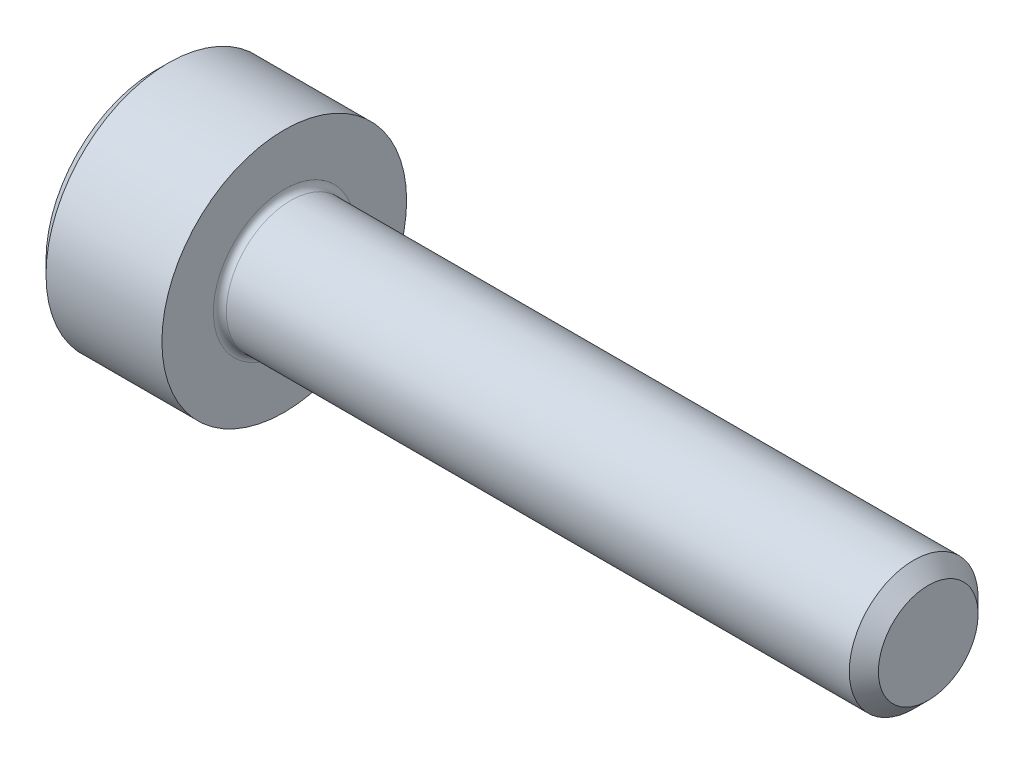
ISO-10303-21;
HEADER;
FILE_DESCRIPTION(('STEP AP214'),'2;1');
FILE_NAME('part.step','',(''),(''),'','','');
FILE_SCHEMA(('AUTOMOTIVE_DESIGN { 1 0 10303 214 1 1 1 1 }'));
ENDSEC;
DATA;
#1=APPLICATION_CONTEXT('core data for automotive mechanical design processes');
#2=APPLICATION_PROTOCOL_DEFINITION('international standard','automotive_design',2000,#1);
#3=PRODUCT_CONTEXT('',#1,'mechanical');
#4=PRODUCT('Part','Part','',(#3));
#5=PRODUCT_RELATED_PRODUCT_CATEGORY('part','',(#4));
#6=PRODUCT_DEFINITION_FORMATION('','',#4);
#7=PRODUCT_DEFINITION_CONTEXT('part definition',#1,'design');
#8=PRODUCT_DEFINITION('design','',#6,#7);
#9=PRODUCT_DEFINITION_SHAPE('','',#8);
#10=(LENGTH_UNIT() NAMED_UNIT(*) SI_UNIT(.MILLI.,.METRE.));
#11=(NAMED_UNIT(*) PLANE_ANGLE_UNIT() SI_UNIT($,.RADIAN.));
#12=(NAMED_UNIT(*) SI_UNIT($,.STERADIAN.) SOLID_ANGLE_UNIT());
#13=UNCERTAINTY_MEASURE_WITH_UNIT(LENGTH_MEASURE(1.E-05),#10,'distance_accuracy_value','');
#14=(GEOMETRIC_REPRESENTATION_CONTEXT(3) GLOBAL_UNCERTAINTY_ASSIGNED_CONTEXT((#13)) GLOBAL_UNIT_ASSIGNED_CONTEXT((#10,
#11,#12)) REPRESENTATION_CONTEXT('',''));
#15=CARTESIAN_POINT('',(0.,0.,0.));
#16=DIRECTION('',(0.,0.,1.));
#17=DIRECTION('',(1.,0.,0.));
#18=AXIS2_PLACEMENT_3D('',#15,#16,#17);
#19=CARTESIAN_POINT('',(0.,0.,0.));
#20=DIRECTION('',(-1.,0.,0.));
#21=DIRECTION('',(0.,0.,1.));
#22=AXIS2_PLACEMENT_3D('',#19,#20,#21);
#23=PLANE('',#22);
#24=DIRECTION('',(0.,-0.499999999999999,0.866025403784439));
#25=VECTOR('',#24,1.);
#26=CARTESIAN_POINT('',(0.,0.892006165897969,0.));
#27=LINE('',#26,#25);
#28=CARTESIAN_POINT('',(0.,0.892006165897969,0.));
#29=VERTEX_POINT('',#28);
#30=CARTESIAN_POINT('',(0.,0.446003082948983,0.772499999999997));
#31=VERTEX_POINT('',#30);
#32=EDGE_CURVE('E391',#29,#31,#27,.T.);
#33=ORIENTED_EDGE('',*,*,#32,.T.);
#34=DIRECTION('',(0.,1.,0.));
#35=VECTOR('',#34,1.);
#36=CARTESIAN_POINT('',(0.,-0.446003082948989,0.772499999999998));
#37=LINE('',#36,#35);
#38=CARTESIAN_POINT('',(0.,-0.446003082948989,0.772499999999998));
#39=VERTEX_POINT('',#38);
#40=EDGE_CURVE('E133',#39,#31,#37,.T.);
#41=ORIENTED_EDGE('',*,*,#40,.F.);
#42=DIRECTION('',(0.,-0.500000000000001,-0.866025403784438));
#43=VECTOR('',#42,1.);
#44=CARTESIAN_POINT('',(0.,-0.446003082948989,0.772499999999998));
#45=LINE('',#44,#43);
#46=CARTESIAN_POINT('',(0.,-0.892006165897975,0.));
#47=VERTEX_POINT('',#46);
#48=EDGE_CURVE('E394',#39,#47,#45,.T.);
#49=ORIENTED_EDGE('',*,*,#48,.T.);
#50=DIRECTION('',(0.,0.499999999999999,-0.866025403784439));
#51=VECTOR('',#50,1.);
#52=CARTESIAN_POINT('',(0.,-0.892006165897975,0.));
#53=LINE('',#52,#51);
#54=CARTESIAN_POINT('',(0.,-0.44600308294899,-0.772500000000001));
#55=VERTEX_POINT('',#54);
#56=EDGE_CURVE('E397',#47,#55,#53,.T.);
#57=ORIENTED_EDGE('',*,*,#56,.T.);
#58=DIRECTION('',(0.,-1.,0.));
#59=VECTOR('',#58,1.);
#60=CARTESIAN_POINT('',(0.,0.446003082948982,-0.772500000000003));
#61=LINE('',#60,#59);
#62=CARTESIAN_POINT('',(0.,0.446003082948982,-0.772500000000003));
#63=VERTEX_POINT('',#62);
#64=EDGE_CURVE('E400',#63,#55,#61,.T.);
#65=ORIENTED_EDGE('',*,*,#64,.F.);
#66=DIRECTION('',(0.,-0.500000000000001,-0.866025403784438));
#67=VECTOR('',#66,1.);
#68=CARTESIAN_POINT('',(0.,0.892006165897969,0.));
#69=LINE('',#68,#67);
#70=EDGE_CURVE('E128',#29,#63,#69,.T.);
#71=ORIENTED_EDGE('',*,*,#70,.F.);
#72=EDGE_LOOP('',(#33,#41,#49,#57,#65,#71));
#73=FACE_BOUND('',#72,.T.);
#74=CARTESIAN_POINT('',(0.,0.,0.));
#75=DIRECTION('',(-1.,0.,0.));
#76=DIRECTION('',(0.,0.,1.));
#77=AXIS2_PLACEMENT_3D('',#74,#75,#76);
#78=CIRCLE('',#77,1.7);
#79=CARTESIAN_POINT('',(0.,0.,1.7));
#80=VERTEX_POINT('',#79);
#81=EDGE_CURVE('E144',#80,#80,#78,.T.);
#82=ORIENTED_EDGE('',*,*,#81,.T.);
#83=EDGE_LOOP('',(#82));
#84=FACE_BOUND('',#83,.T.);
#85=ADVANCED_FACE('F37',(#73,#84),#23,.T.);
#86=CARTESIAN_POINT('',(12.,0.774,0.));
#87=DIRECTION('',(1.,0.,0.));
#88=DIRECTION('',(0.,0.,-1.));
#89=AXIS2_PLACEMENT_3D('',#86,#87,#88);
#90=PLANE('',#89);
#91=CARTESIAN_POINT('',(12.,0.,0.));
#92=DIRECTION('',(-1.,0.,0.));
#93=DIRECTION('',(0.,0.,1.));
#94=AXIS2_PLACEMENT_3D('',#91,#92,#93);
#95=CIRCLE('',#94,0.774);
#96=CARTESIAN_POINT('',(12.,0.,0.774));
#97=VERTEX_POINT('',#96);
#98=EDGE_CURVE('E157',#97,#97,#95,.T.);
#99=ORIENTED_EDGE('',*,*,#98,.F.);
#100=EDGE_LOOP('',(#99));
#101=FACE_BOUND('',#100,.T.);
#102=ADVANCED_FACE('F178',(#101),#90,.T.);
#103=CARTESIAN_POINT('',(12.,0.,0.));
#104=DIRECTION('',(-1.,0.,0.));
#105=DIRECTION('',(0.,0.,1.));
#106=AXIS2_PLACEMENT_3D('',#103,#104,#105);
#107=CONICAL_SURFACE('',#106,0.774,0.785398163397409);
#108=CARTESIAN_POINT('',(11.774,0.,0.));
#109=DIRECTION('',(-1.,0.,0.));
#110=DIRECTION('',(0.,0.,1.));
#111=AXIS2_PLACEMENT_3D('',#108,#109,#110);
#112=CIRCLE('',#111,0.999999999999986);
#113=CARTESIAN_POINT('',(11.774,0.,0.999999999999986));
#114=VERTEX_POINT('',#113);
#115=EDGE_CURVE('E154',#114,#114,#112,.T.);
#116=ORIENTED_EDGE('',*,*,#115,.F.);
#117=EDGE_LOOP('',(#116));
#118=FACE_BOUND('',#117,.T.);
#119=ORIENTED_EDGE('',*,*,#98,.T.);
#120=EDGE_LOOP('',(#119));
#121=FACE_BOUND('',#120,.T.);
#122=ADVANCED_FACE('F184',(#118,#121),#107,.T.);
#123=CARTESIAN_POINT('',(-31.75,0.,0.));
#124=DIRECTION('',(-1.,0.,0.));
#125=DIRECTION('',(0.,0.,1.));
#126=AXIS2_PLACEMENT_3D('',#123,#124,#125);
#127=CYLINDRICAL_SURFACE('',#126,0.999999999999994);
#128=CARTESIAN_POINT('',(2.1,0.,0.));
#129=DIRECTION('',(1.,0.,0.));
#130=DIRECTION('',(0.,0.,-1.));
#131=AXIS2_PLACEMENT_3D('',#128,#129,#130);
#132=CIRCLE('',#131,0.999999999999994);
#133=CARTESIAN_POINT('',(2.1,0.,-0.999999999999994));
#134=VERTEX_POINT('',#133);
#135=EDGE_CURVE('E11',#134,#134,#132,.T.);
#136=ORIENTED_EDGE('',*,*,#135,.T.);
#137=EDGE_LOOP('',(#136));
#138=FACE_BOUND('',#137,.T.);
#139=ORIENTED_EDGE('',*,*,#115,.T.);
#140=EDGE_LOOP('',(#139));
#141=FACE_BOUND('',#140,.T.);
#142=ADVANCED_FACE('F195',(#138,#141),#127,.T.);
#143=CARTESIAN_POINT('',(2.,1.9,0.));
#144=DIRECTION('',(1.,0.,0.));
#145=DIRECTION('',(0.,0.,-1.));
#146=AXIS2_PLACEMENT_3D('',#143,#144,#145);
#147=PLANE('',#146);
#148=CARTESIAN_POINT('',(2.,0.,0.));
#149=DIRECTION('',(1.,0.,0.));
#150=DIRECTION('',(0.,0.,-1.));
#151=AXIS2_PLACEMENT_3D('',#148,#149,#150);
#152=CIRCLE('',#151,1.09999999999999);
#153=CARTESIAN_POINT('',(2.,0.,-1.09999999999999));
#154=VERTEX_POINT('',#153);
#155=EDGE_CURVE('E45',#154,#154,#152,.F.);
#156=ORIENTED_EDGE('',*,*,#155,.T.);
#157=EDGE_LOOP('',(#156));
#158=FACE_BOUND('',#157,.T.);
#159=CARTESIAN_POINT('',(2.,0.,0.));
#160=DIRECTION('',(-1.,0.,0.));
#161=DIRECTION('',(0.,0.,1.));
#162=AXIS2_PLACEMENT_3D('',#159,#160,#161);
#163=CIRCLE('',#162,1.9);
#164=CARTESIAN_POINT('',(2.,0.,1.9));
#165=VERTEX_POINT('',#164);
#166=EDGE_CURVE('E151',#165,#165,#163,.T.);
#167=ORIENTED_EDGE('',*,*,#166,.F.);
#168=EDGE_LOOP('',(#167));
#169=FACE_BOUND('',#168,.T.);
#170=ADVANCED_FACE('F162',(#158,#169),#147,.T.);
#171=CARTESIAN_POINT('',(-31.75,0.,0.));
#172=DIRECTION('',(-1.,0.,0.));
#173=DIRECTION('',(0.,0.,1.));
#174=AXIS2_PLACEMENT_3D('',#171,#172,#173);
#175=CYLINDRICAL_SURFACE('',#174,1.9);
#176=ORIENTED_EDGE('',*,*,#166,.T.);
#177=EDGE_LOOP('',(#176));
#178=FACE_BOUND('',#177,.T.);
#179=CARTESIAN_POINT('',(0.199999999999999,0.,0.));
#180=DIRECTION('',(-1.,0.,0.));
#181=DIRECTION('',(0.,0.,1.));
#182=AXIS2_PLACEMENT_3D('',#179,#180,#181);
#183=CIRCLE('',#182,1.9);
#184=CARTESIAN_POINT('',(0.199999999999999,0.,1.9));
#185=VERTEX_POINT('',#184);
#186=EDGE_CURVE('E148',#185,#185,#183,.T.);
#187=ORIENTED_EDGE('',*,*,#186,.F.);
#188=EDGE_LOOP('',(#187));
#189=FACE_BOUND('',#188,.T.);
#190=ADVANCED_FACE('F173',(#178,#189),#175,.T.);
#191=CARTESIAN_POINT('',(0.,0.,0.));
#192=DIRECTION('',(1.,0.,0.));
#193=DIRECTION('',(0.,0.,-1.));
#194=AXIS2_PLACEMENT_3D('',#191,#192,#193);
#195=CONICAL_SURFACE('',#194,1.7,0.785398163397448);
#196=ORIENTED_EDGE('',*,*,#186,.T.);
#197=EDGE_LOOP('',(#196));
#198=FACE_BOUND('',#197,.T.);
#199=ORIENTED_EDGE('',*,*,#81,.F.);
#200=EDGE_LOOP('',(#199));
#201=FACE_BOUND('',#200,.T.);
#202=ADVANCED_FACE('F166',(#198,#201),#195,.T.);
#203=CARTESIAN_POINT('',(2.1,0.,0.));
#204=DIRECTION('',(1.,0.,0.));
#205=DIRECTION('',(0.,0.,-1.));
#206=AXIS2_PLACEMENT_3D('',#203,#204,#205);
#207=TOROIDAL_SURFACE('',#206,1.09999999999999,0.1);
#208=ORIENTED_EDGE('',*,*,#135,.F.);
#209=EDGE_LOOP('',(#208));
#210=FACE_BOUND('',#209,.T.);
#211=ORIENTED_EDGE('',*,*,#155,.F.);
#212=EDGE_LOOP('',(#211));
#213=FACE_BOUND('',#212,.T.);
#214=ADVANCED_FACE('F39',(#210,#213),#207,.F.);
#215=CARTESIAN_POINT('',(1.,0.892006165897969,0.));
#216=DIRECTION('',(0.,-0.866025403784439,-0.499999999999999));
#217=DIRECTION('',(0.,0.499999999999999,-0.866025403784439));
#218=AXIS2_PLACEMENT_3D('',#215,#216,#217);
#219=PLANE('',#218);
#220=ORIENTED_EDGE('',*,*,#32,.F.);
#221=DIRECTION('',(-1.,0.,0.));
#222=VECTOR('',#221,1.);
#223=CARTESIAN_POINT('',(1.,0.892006165897969,0.));
#224=LINE('',#223,#222);
#225=CARTESIAN_POINT('',(1.,0.892006165897969,0.));
#226=VERTEX_POINT('',#225);
#227=EDGE_CURVE('E381',#226,#29,#224,.T.);
#228=ORIENTED_EDGE('',*,*,#227,.F.);
#229=DIRECTION('',(0.,-0.499999999999999,0.866025403784439));
#230=VECTOR('',#229,1.);
#231=CARTESIAN_POINT('',(1.,0.892006165897969,0.));
#232=LINE('',#231,#230);
#233=CARTESIAN_POINT('',(1.,0.669004624423476,0.386249999999998));
#234=VERTEX_POINT('',#233);
#235=EDGE_CURVE('E120',#226,#234,#232,.T.);
#236=ORIENTED_EDGE('',*,*,#235,.T.);
#237=CARTESIAN_POINT('',(1.,0.446003082948983,0.772499999999997));
#238=VERTEX_POINT('',#237);
#239=EDGE_CURVE('E111',#234,#238,#232,.T.);
#240=ORIENTED_EDGE('',*,*,#239,.T.);
#241=DIRECTION('',(-1.,0.,0.));
#242=VECTOR('',#241,1.);
#243=CARTESIAN_POINT('',(1.,0.446003082948983,0.772499999999997));
#244=LINE('',#243,#242);
#245=EDGE_CURVE('E125',#238,#31,#244,.T.);
#246=ORIENTED_EDGE('',*,*,#245,.T.);
#247=EDGE_LOOP('',(#220,#228,#236,#240,#246));
#248=FACE_BOUND('',#247,.T.);
#249=ADVANCED_FACE('F124',(#248),#219,.T.);
#250=CARTESIAN_POINT('',(1.,-0.446003082948989,0.772499999999998));
#251=DIRECTION('',(0.,0.,1.));
#252=DIRECTION('',(0.,-1.,0.));
#253=AXIS2_PLACEMENT_3D('',#250,#251,#252);
#254=PLANE('',#253);
#255=ORIENTED_EDGE('',*,*,#40,.T.);
#256=ORIENTED_EDGE('',*,*,#245,.F.);
#257=DIRECTION('',(0.,1.,0.));
#258=VECTOR('',#257,1.);
#259=CARTESIAN_POINT('',(1.,-0.446003082948989,0.772499999999998));
#260=LINE('',#259,#258);
#261=CARTESIAN_POINT('',(1.,0.,0.772499999999998));
#262=VERTEX_POINT('',#261);
#263=EDGE_CURVE('E108',#262,#238,#260,.T.);
#264=ORIENTED_EDGE('',*,*,#263,.F.);
#265=CARTESIAN_POINT('',(1.,-0.446003082948989,0.772499999999998));
#266=VERTEX_POINT('',#265);
#267=EDGE_CURVE('E119',#266,#262,#260,.T.);
#268=ORIENTED_EDGE('',*,*,#267,.F.);
#269=DIRECTION('',(-1.,0.,0.));
#270=VECTOR('',#269,1.);
#271=CARTESIAN_POINT('',(1.,-0.446003082948989,0.772499999999998));
#272=LINE('',#271,#270);
#273=EDGE_CURVE('E135',#266,#39,#272,.T.);
#274=ORIENTED_EDGE('',*,*,#273,.T.);
#275=EDGE_LOOP('',(#255,#256,#264,#268,#274));
#276=FACE_BOUND('',#275,.T.);
#277=ADVANCED_FACE('F130',(#276),#254,.F.);
#278=CARTESIAN_POINT('',(1.,-0.446003082948989,0.772499999999998));
#279=DIRECTION('',(0.,0.866025403784438,-0.500000000000001));
#280=DIRECTION('',(0.,0.500000000000001,0.866025403784438));
#281=AXIS2_PLACEMENT_3D('',#278,#279,#280);
#282=PLANE('',#281);
#283=ORIENTED_EDGE('',*,*,#48,.F.);
#284=ORIENTED_EDGE('',*,*,#273,.F.);
#285=DIRECTION('',(0.,-0.500000000000001,-0.866025403784438));
#286=VECTOR('',#285,1.);
#287=CARTESIAN_POINT('',(1.,-0.446003082948989,0.772499999999998));
#288=LINE('',#287,#286);
#289=CARTESIAN_POINT('',(1.,-0.66900462442348,0.386250000000002));
#290=VERTEX_POINT('',#289);
#291=EDGE_CURVE('E420',#266,#290,#288,.T.);
#292=ORIENTED_EDGE('',*,*,#291,.T.);
#293=CARTESIAN_POINT('',(1.,-0.892006165897975,0.));
#294=VERTEX_POINT('',#293);
#295=EDGE_CURVE('E409',#290,#294,#288,.T.);
#296=ORIENTED_EDGE('',*,*,#295,.T.);
#297=DIRECTION('',(-1.,0.,0.));
#298=VECTOR('',#297,1.);
#299=CARTESIAN_POINT('',(1.,-0.892006165897975,0.));
#300=LINE('',#299,#298);
#301=EDGE_CURVE('E140',#294,#47,#300,.T.);
#302=ORIENTED_EDGE('',*,*,#301,.T.);
#303=EDGE_LOOP('',(#283,#284,#292,#296,#302));
#304=FACE_BOUND('',#303,.T.);
#305=ADVANCED_FACE('F272',(#304),#282,.T.);
#306=CARTESIAN_POINT('',(1.,-0.892006165897975,0.));
#307=DIRECTION('',(0.,0.866025403784439,0.5));
#308=DIRECTION('',(0.,-0.499999999999999,0.866025403784439));
#309=AXIS2_PLACEMENT_3D('',#306,#307,#308);
#310=PLANE('',#309);
#311=ORIENTED_EDGE('',*,*,#56,.F.);
#312=ORIENTED_EDGE('',*,*,#301,.F.);
#313=DIRECTION('',(0.,0.499999999999999,-0.866025403784439));
#314=VECTOR('',#313,1.);
#315=CARTESIAN_POINT('',(1.,-0.892006165897975,0.));
#316=LINE('',#315,#314);
#317=CARTESIAN_POINT('',(1.,-0.669004624423482,-0.386250000000001));
#318=VERTEX_POINT('',#317);
#319=EDGE_CURVE('E387',#294,#318,#316,.T.);
#320=ORIENTED_EDGE('',*,*,#319,.T.);
#321=CARTESIAN_POINT('',(1.,-0.44600308294899,-0.772500000000001));
#322=VERTEX_POINT('',#321);
#323=EDGE_CURVE('E419',#318,#322,#316,.T.);
#324=ORIENTED_EDGE('',*,*,#323,.T.);
#325=DIRECTION('',(-1.,0.,0.));
#326=VECTOR('',#325,1.);
#327=CARTESIAN_POINT('',(1.,-0.44600308294899,-0.772500000000001));
#328=LINE('',#327,#326);
#329=EDGE_CURVE('E380',#322,#55,#328,.T.);
#330=ORIENTED_EDGE('',*,*,#329,.T.);
#331=EDGE_LOOP('',(#311,#312,#320,#324,#330));
#332=FACE_BOUND('',#331,.T.);
#333=ADVANCED_FACE('F280',(#332),#310,.T.);
#334=CARTESIAN_POINT('',(1.,0.446003082948982,-0.772500000000003));
#335=DIRECTION('',(0.,0.,-1.));
#336=DIRECTION('',(0.,1.,0.));
#337=AXIS2_PLACEMENT_3D('',#334,#335,#336);
#338=PLANE('',#337);
#339=ORIENTED_EDGE('',*,*,#64,.T.);
#340=ORIENTED_EDGE('',*,*,#329,.F.);
#341=DIRECTION('',(0.,-1.,0.));
#342=VECTOR('',#341,1.);
#343=CARTESIAN_POINT('',(1.,0.446003082948982,-0.772500000000003));
#344=LINE('',#343,#342);
#345=CARTESIAN_POINT('',(1.,0.,-0.7725));
#346=VERTEX_POINT('',#345);
#347=EDGE_CURVE('E384',#346,#322,#344,.T.);
#348=ORIENTED_EDGE('',*,*,#347,.F.);
#349=CARTESIAN_POINT('',(1.,0.446003082948982,-0.772500000000003));
#350=VERTEX_POINT('',#349);
#351=EDGE_CURVE('E52',#350,#346,#344,.T.);
#352=ORIENTED_EDGE('',*,*,#351,.F.);
#353=DIRECTION('',(-1.,0.,0.));
#354=VECTOR('',#353,1.);
#355=CARTESIAN_POINT('',(1.,0.446003082948982,-0.772500000000003));
#356=LINE('',#355,#354);
#357=EDGE_CURVE('E377',#350,#63,#356,.T.);
#358=ORIENTED_EDGE('',*,*,#357,.T.);
#359=EDGE_LOOP('',(#339,#340,#348,#352,#358));
#360=FACE_BOUND('',#359,.T.);
#361=ADVANCED_FACE('F289',(#360),#338,.F.);
#362=CARTESIAN_POINT('',(1.,0.892006165897969,0.));
#363=DIRECTION('',(0.,0.866025403784438,-0.500000000000001));
#364=DIRECTION('',(0.,0.500000000000001,0.866025403784438));
#365=AXIS2_PLACEMENT_3D('',#362,#363,#364);
#366=PLANE('',#365);
#367=ORIENTED_EDGE('',*,*,#70,.T.);
#368=ORIENTED_EDGE('',*,*,#357,.F.);
#369=DIRECTION('',(0.,-0.500000000000001,-0.866025403784438));
#370=VECTOR('',#369,1.);
#371=CARTESIAN_POINT('',(1.,0.892006165897969,0.));
#372=LINE('',#371,#370);
#373=CARTESIAN_POINT('',(1.,0.669004624423477,-0.38625));
#374=VERTEX_POINT('',#373);
#375=EDGE_CURVE('E367',#374,#350,#372,.T.);
#376=ORIENTED_EDGE('',*,*,#375,.F.);
#377=EDGE_CURVE('E373',#226,#374,#372,.T.);
#378=ORIENTED_EDGE('',*,*,#377,.F.);
#379=ORIENTED_EDGE('',*,*,#227,.T.);
#380=EDGE_LOOP('',(#367,#368,#376,#378,#379));
#381=FACE_BOUND('',#380,.T.);
#382=ADVANCED_FACE('F298',(#381),#366,.F.);
#383=CARTESIAN_POINT('',(1.,0.,1.545));
#384=DIRECTION('',(1.,0.,0.));
#385=DIRECTION('',(0.,0.,-1.));
#386=AXIS2_PLACEMENT_3D('',#383,#384,#385);
#387=PLANE('',#386);
#388=ORIENTED_EDGE('',*,*,#347,.T.);
#389=ORIENTED_EDGE('',*,*,#323,.F.);
#390=CARTESIAN_POINT('',(1.,0.,0.));
#391=DIRECTION('',(-1.,0.,0.));
#392=DIRECTION('',(0.,0.,1.));
#393=AXIS2_PLACEMENT_3D('',#390,#391,#392);
#394=CIRCLE('',#393,0.7725);
#395=EDGE_CURVE('E415',#346,#318,#394,.T.);
#396=ORIENTED_EDGE('',*,*,#395,.F.);
#397=EDGE_LOOP('',(#388,#389,#396));
#398=FACE_BOUND('',#397,.T.);
#399=ADVANCED_FACE('F307',(#398),#387,.F.);
#400=ORIENTED_EDGE('',*,*,#319,.F.);
#401=ORIENTED_EDGE('',*,*,#295,.F.);
#402=EDGE_CURVE('E138',#318,#290,#394,.T.);
#403=ORIENTED_EDGE('',*,*,#402,.F.);
#404=EDGE_LOOP('',(#400,#401,#403));
#405=FACE_BOUND('',#404,.T.);
#406=ADVANCED_FACE('F316',(#405),#387,.F.);
#407=ORIENTED_EDGE('',*,*,#291,.F.);
#408=ORIENTED_EDGE('',*,*,#267,.T.);
#409=EDGE_CURVE('E134',#290,#262,#394,.T.);
#410=ORIENTED_EDGE('',*,*,#409,.F.);
#411=EDGE_LOOP('',(#407,#408,#410));
#412=FACE_BOUND('',#411,.T.);
#413=ADVANCED_FACE('F325',(#412),#387,.F.);
#414=ORIENTED_EDGE('',*,*,#263,.T.);
#415=ORIENTED_EDGE('',*,*,#239,.F.);
#416=EDGE_CURVE('E114',#262,#234,#394,.T.);
#417=ORIENTED_EDGE('',*,*,#416,.F.);
#418=EDGE_LOOP('',(#414,#415,#417));
#419=FACE_BOUND('',#418,.T.);
#420=ADVANCED_FACE('F110',(#419),#387,.F.);
#421=ORIENTED_EDGE('',*,*,#235,.F.);
#422=ORIENTED_EDGE('',*,*,#377,.T.);
#423=EDGE_CURVE('E145',#234,#374,#394,.T.);
#424=ORIENTED_EDGE('',*,*,#423,.F.);
#425=EDGE_LOOP('',(#421,#422,#424));
#426=FACE_BOUND('',#425,.T.);
#427=ADVANCED_FACE('F340',(#426),#387,.F.);
#428=ORIENTED_EDGE('',*,*,#375,.T.);
#429=ORIENTED_EDGE('',*,*,#351,.T.);
#430=EDGE_CURVE('E370',#374,#346,#394,.T.);
#431=ORIENTED_EDGE('',*,*,#430,.F.);
#432=EDGE_LOOP('',(#428,#429,#431));
#433=FACE_BOUND('',#432,.T.);
#434=ADVANCED_FACE('F255',(#433),#387,.F.);
#435=CARTESIAN_POINT('',(1.,0.,0.));
#436=DIRECTION('',(-1.,0.,0.));
#437=DIRECTION('',(0.,0.,1.));
#438=AXIS2_PLACEMENT_3D('',#435,#436,#437);
#439=CONICAL_SURFACE('',#438,0.7725,1.04719755119659);
#440=CARTESIAN_POINT('',(1.446003082949,0.,0.));
#441=VERTEX_POINT('',#440);
#442=VERTEX_LOOP('',#441);
#443=FACE_BOUND('',#442,.T.);
#444=ORIENTED_EDGE('',*,*,#416,.T.);
#445=ORIENTED_EDGE('',*,*,#423,.T.);
#446=ORIENTED_EDGE('',*,*,#430,.T.);
#447=ORIENTED_EDGE('',*,*,#395,.T.);
#448=ORIENTED_EDGE('',*,*,#402,.T.);
#449=ORIENTED_EDGE('',*,*,#409,.T.);
#450=EDGE_LOOP('',(#444,#445,#446,#447,#448,#449));
#451=FACE_BOUND('',#450,.T.);
#452=ADVANCED_FACE('F188',(#443,#451),#439,.F.);
#453=CLOSED_SHELL('',(#85,#102,#122,#142,#170,#190,#202,#214,#249,#277,#305,#333,#361,#382,#399,
#406,#413,#420,#427,#434,#452));
#454=MANIFOLD_SOLID_BREP('B2',#453);
#455=ADVANCED_BREP_SHAPE_REPRESENTATION('',(#18,#454),#14);
#456=SHAPE_DEFINITION_REPRESENTATION(#9,#455);
ENDSEC;
END-ISO-10303-21;
